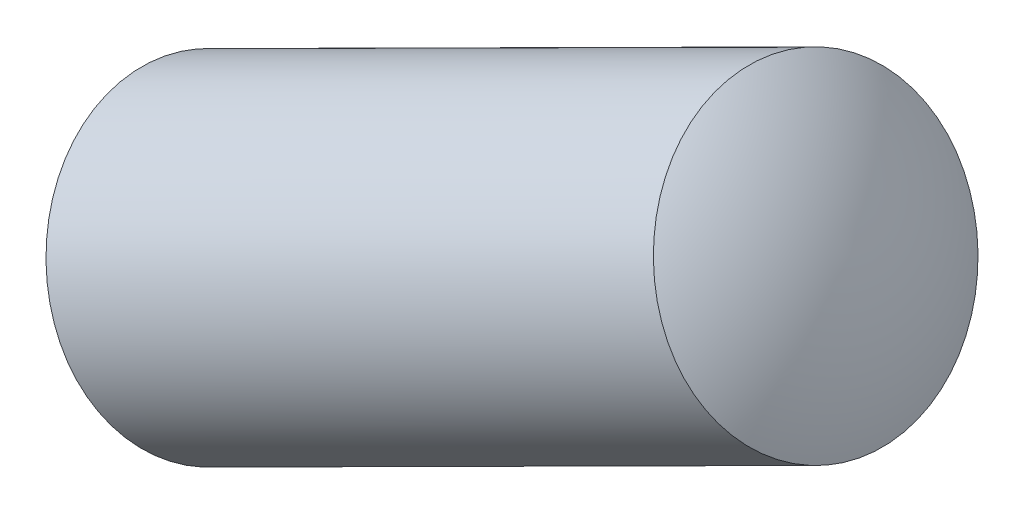
ISO-10303-21;
HEADER;
FILE_DESCRIPTION(('STEP AP214'),'2;1');
FILE_NAME('part.step','',(''),(''),'','','');
FILE_SCHEMA(('AUTOMOTIVE_DESIGN { 1 0 10303 214 1 1 1 1 }'));
ENDSEC;
DATA;
#1=APPLICATION_CONTEXT('core data for automotive mechanical design processes');
#2=APPLICATION_PROTOCOL_DEFINITION('international standard','automotive_design',2000,#1);
#3=PRODUCT_CONTEXT('',#1,'mechanical');
#4=PRODUCT('Part','Part','',(#3));
#5=PRODUCT_RELATED_PRODUCT_CATEGORY('part','',(#4));
#6=PRODUCT_DEFINITION_FORMATION('','',#4);
#7=PRODUCT_DEFINITION_CONTEXT('part definition',#1,'design');
#8=PRODUCT_DEFINITION('design','',#6,#7);
#9=PRODUCT_DEFINITION_SHAPE('','',#8);
#10=(LENGTH_UNIT() NAMED_UNIT(*) SI_UNIT(.MILLI.,.METRE.));
#11=(NAMED_UNIT(*) PLANE_ANGLE_UNIT() SI_UNIT($,.RADIAN.));
#12=(NAMED_UNIT(*) SI_UNIT($,.STERADIAN.) SOLID_ANGLE_UNIT());
#13=UNCERTAINTY_MEASURE_WITH_UNIT(LENGTH_MEASURE(1.E-05),#10,'distance_accuracy_value','');
#14=(GEOMETRIC_REPRESENTATION_CONTEXT(3) GLOBAL_UNCERTAINTY_ASSIGNED_CONTEXT((#13)) GLOBAL_UNIT_ASSIGNED_CONTEXT((#10,
#11,#12)) REPRESENTATION_CONTEXT('',''));
#15=CARTESIAN_POINT('',(0.,0.,0.));
#16=DIRECTION('',(0.,0.,1.));
#17=DIRECTION('',(1.,0.,0.));
#18=AXIS2_PLACEMENT_3D('',#15,#16,#17);
#19=CARTESIAN_POINT('',(19.9382488991166,10.0166827094047,0.6));
#20=DIRECTION('',(0.448917918604973,-0.893572997776555,0.));
#21=DIRECTION('',(0.893572997776555,0.448917918604973,0.));
#22=AXIS2_PLACEMENT_3D('',#19,#20,#21);
#23=SPHERICAL_SURFACE('',#22,2.);
#24=CARTESIAN_POINT('',(19.9382488991166,10.0166827094047,0.6));
#25=DIRECTION('',(-0.893572997776555,-0.448917918604973,0.));
#26=DIRECTION('',(0.,0.,-1.));
#27=AXIS2_PLACEMENT_3D('',#24,#25,#26);
#28=SPHERICAL_SURFACE('',#27,2.);
#29=CARTESIAN_POINT('',(21.4859627315372,10.7942313528565,0.6));
#30=DIRECTION('',(-0.893572997776555,-0.448917918604973,0.));
#31=DIRECTION('',(0.,0.,-1.));
#32=AXIS2_PLACEMENT_3D('',#29,#30,#31);
#33=CIRCLE('',#32,1.);
#34=CARTESIAN_POINT('',(21.4859627315372,10.7942313528565,-0.4));
#35=VERTEX_POINT('',#34);
#36=EDGE_CURVE('E11',#35,#35,#33,.T.);
#37=ORIENTED_EDGE('',*,*,#36,.F.);
#38=EDGE_LOOP('',(#37));
#39=FACE_BOUND('',#38,.T.);
#40=ADVANCED_FACE('F17',(#39),#28,.T.);
#41=CARTESIAN_POINT('',(18.9321765041635,9.51124674991166,0.6));
#42=DIRECTION('',(0.448917918604973,-0.893572997776555,0.));
#43=DIRECTION('',(-0.893572997776555,-0.448917918604973,0.));
#44=AXIS2_PLACEMENT_3D('',#41,#42,#43);
#45=SPHERICAL_SURFACE('',#44,2.);
#46=CARTESIAN_POINT('',(18.9321765041635,9.51124674991166,0.6));
#47=DIRECTION('',(-0.893572997776555,-0.448917918604973,0.));
#48=DIRECTION('',(0.,0.,-1.));
#49=AXIS2_PLACEMENT_3D('',#46,#47,#48);
#50=SPHERICAL_SURFACE('',#49,2.);
#51=CARTESIAN_POINT('',(17.3844626717428,8.73369810645974,0.6));
#52=DIRECTION('',(-0.893572997776555,-0.448917918604973,0.));
#53=DIRECTION('',(0.,0.,-1.));
#54=AXIS2_PLACEMENT_3D('',#51,#52,#53);
#55=CIRCLE('',#54,1.);
#56=CARTESIAN_POINT('',(17.3844626717428,8.73369810645974,-0.4));
#57=VERTEX_POINT('',#56);
#58=EDGE_CURVE('E27',#57,#57,#55,.T.);
#59=ORIENTED_EDGE('',*,*,#58,.T.);
#60=EDGE_LOOP('',(#59));
#61=FACE_BOUND('',#60,.T.);
#62=ADVANCED_FACE('F19',(#61),#50,.T.);
#63=CARTESIAN_POINT('',(18.4098376866915,9.24883141805899,0.6));
#64=DIRECTION('',(-0.893572997776555,-0.448917918604973,0.));
#65=DIRECTION('',(0.,0.,-1.));
#66=AXIS2_PLACEMENT_3D('',#63,#64,#65);
#67=CYLINDRICAL_SURFACE('',#66,1.);
#68=ORIENTED_EDGE('',*,*,#36,.T.);
#69=EDGE_LOOP('',(#68));
#70=FACE_BOUND('',#69,.T.);
#71=ORIENTED_EDGE('',*,*,#58,.F.);
#72=EDGE_LOOP('',(#71));
#73=FACE_BOUND('',#72,.T.);
#74=ADVANCED_FACE('F57',(#70,#73),#67,.T.);
#75=CLOSED_SHELL('',(#40,#62,#74));
#76=MANIFOLD_SOLID_BREP('B1',#75);
#77=ADVANCED_BREP_SHAPE_REPRESENTATION('',(#18,#76),#14);
#78=SHAPE_DEFINITION_REPRESENTATION(#9,#77);
ENDSEC;
END-ISO-10303-21;
